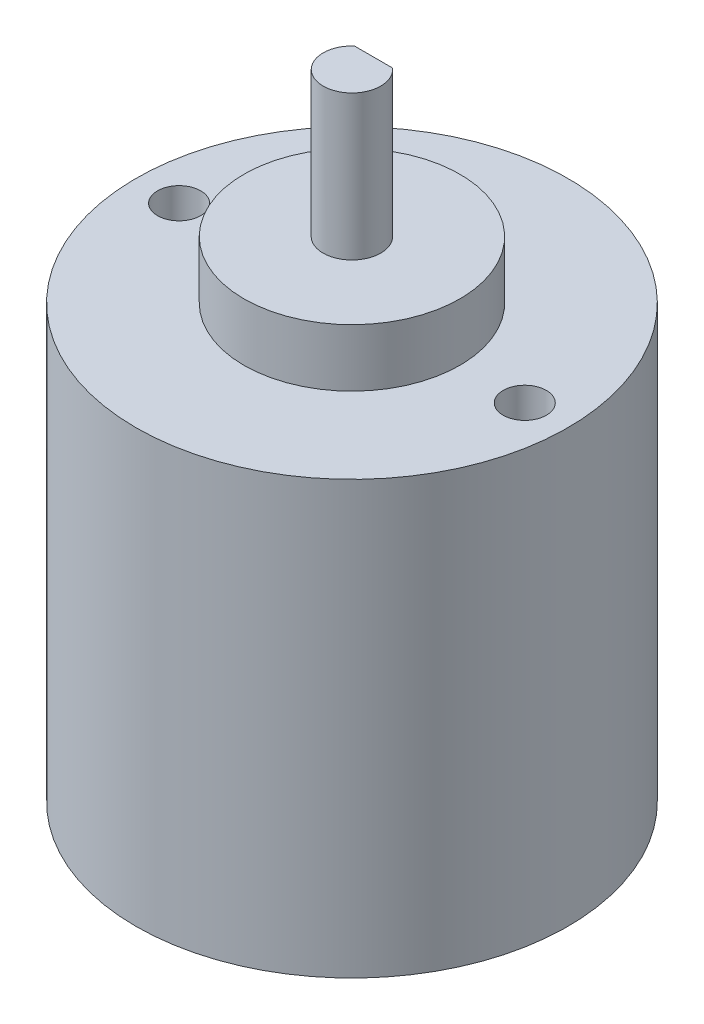
ISO-10303-21;
HEADER;
FILE_DESCRIPTION(('STEP AP214'),'2;1');
FILE_NAME('part.step','',(''),(''),'','','');
FILE_SCHEMA(('AUTOMOTIVE_DESIGN { 1 0 10303 214 1 1 1 1 }'));
ENDSEC;
DATA;
#1=APPLICATION_CONTEXT('core data for automotive mechanical design processes');
#2=APPLICATION_PROTOCOL_DEFINITION('international standard','automotive_design',2000,#1);
#3=PRODUCT_CONTEXT('',#1,'mechanical');
#4=PRODUCT('Part','Part','',(#3));
#5=PRODUCT_RELATED_PRODUCT_CATEGORY('part','',(#4));
#6=PRODUCT_DEFINITION_FORMATION('','',#4);
#7=PRODUCT_DEFINITION_CONTEXT('part definition',#1,'design');
#8=PRODUCT_DEFINITION('design','',#6,#7);
#9=PRODUCT_DEFINITION_SHAPE('','',#8);
#10=(LENGTH_UNIT() NAMED_UNIT(*) SI_UNIT(.MILLI.,.METRE.));
#11=(NAMED_UNIT(*) PLANE_ANGLE_UNIT() SI_UNIT($,.RADIAN.));
#12=(NAMED_UNIT(*) SI_UNIT($,.STERADIAN.) SOLID_ANGLE_UNIT());
#13=UNCERTAINTY_MEASURE_WITH_UNIT(LENGTH_MEASURE(1.E-05),#10,'distance_accuracy_value','');
#14=(GEOMETRIC_REPRESENTATION_CONTEXT(3) GLOBAL_UNCERTAINTY_ASSIGNED_CONTEXT((#13)) GLOBAL_UNIT_ASSIGNED_CONTEXT((#10,
#11,#12)) REPRESENTATION_CONTEXT('',''));
#15=CARTESIAN_POINT('',(0.,0.,0.));
#16=DIRECTION('',(0.,0.,1.));
#17=DIRECTION('',(1.,0.,0.));
#18=AXIS2_PLACEMENT_3D('',#15,#16,#17);
#19=CARTESIAN_POINT('',(0.,30.,0.));
#20=DIRECTION('',(0.,-1.,0.));
#21=DIRECTION('',(0.,0.,-1.));
#22=AXIS2_PLACEMENT_3D('',#19,#20,#21);
#23=CYLINDRICAL_SURFACE('',#22,15.);
#24=CARTESIAN_POINT('',(0.,30.,0.));
#25=DIRECTION('',(0.,1.,0.));
#26=DIRECTION('',(0.,0.,1.));
#27=AXIS2_PLACEMENT_3D('',#24,#25,#26);
#28=CIRCLE('',#27,15.);
#29=CARTESIAN_POINT('',(0.,30.,15.));
#30=VERTEX_POINT('',#29);
#31=EDGE_CURVE('E98',#30,#30,#28,.T.);
#32=ORIENTED_EDGE('',*,*,#31,.F.);
#33=EDGE_LOOP('',(#32));
#34=FACE_BOUND('',#33,.T.);
#35=CARTESIAN_POINT('',(0.,0.,0.));
#36=DIRECTION('',(0.,1.,0.));
#37=DIRECTION('',(0.,0.,1.));
#38=AXIS2_PLACEMENT_3D('',#35,#36,#37);
#39=CIRCLE('',#38,15.);
#40=CARTESIAN_POINT('',(0.,0.,15.));
#41=VERTEX_POINT('',#40);
#42=EDGE_CURVE('E111',#41,#41,#39,.T.);
#43=ORIENTED_EDGE('',*,*,#42,.T.);
#44=EDGE_LOOP('',(#43));
#45=FACE_BOUND('',#44,.T.);
#46=ADVANCED_FACE('F42',(#34,#45),#23,.T.);
#47=CARTESIAN_POINT('',(0.,30.,0.));
#48=DIRECTION('',(0.,1.,0.));
#49=DIRECTION('',(0.,0.,1.));
#50=AXIS2_PLACEMENT_3D('',#47,#48,#49);
#51=PLANE('',#50);
#52=CARTESIAN_POINT('',(0.,30.,0.));
#53=DIRECTION('',(0.,1.,0.));
#54=DIRECTION('',(0.,0.,1.));
#55=AXIS2_PLACEMENT_3D('',#52,#53,#54);
#56=CIRCLE('',#55,7.5);
#57=CARTESIAN_POINT('',(0.,30.,7.5));
#58=VERTEX_POINT('',#57);
#59=EDGE_CURVE('E75',#58,#58,#56,.T.);
#60=ORIENTED_EDGE('',*,*,#59,.F.);
#61=EDGE_LOOP('',(#60));
#62=FACE_BOUND('',#61,.T.);
#63=CARTESIAN_POINT('',(12.005,30.,0.));
#64=DIRECTION('',(0.,1.,0.));
#65=DIRECTION('',(0.,0.,1.));
#66=AXIS2_PLACEMENT_3D('',#63,#64,#65);
#67=CIRCLE('',#66,1.5);
#68=CARTESIAN_POINT('',(12.005,30.,1.5));
#69=VERTEX_POINT('',#68);
#70=EDGE_CURVE('E112',#69,#69,#67,.T.);
#71=ORIENTED_EDGE('',*,*,#70,.F.);
#72=EDGE_LOOP('',(#71));
#73=FACE_BOUND('',#72,.T.);
#74=CARTESIAN_POINT('',(-12.005,30.,0.));
#75=DIRECTION('',(0.,1.,0.));
#76=DIRECTION('',(0.,0.,1.));
#77=AXIS2_PLACEMENT_3D('',#74,#75,#76);
#78=CIRCLE('',#77,1.5);
#79=CARTESIAN_POINT('',(-12.005,30.,1.5));
#80=VERTEX_POINT('',#79);
#81=EDGE_CURVE('E116',#80,#80,#78,.T.);
#82=ORIENTED_EDGE('',*,*,#81,.F.);
#83=EDGE_LOOP('',(#82));
#84=FACE_BOUND('',#83,.T.);
#85=ORIENTED_EDGE('',*,*,#31,.T.);
#86=EDGE_LOOP('',(#85));
#87=FACE_BOUND('',#86,.T.);
#88=ADVANCED_FACE('F133',(#62,#73,#84,#87),#51,.T.);
#89=CARTESIAN_POINT('',(0.,0.,0.));
#90=DIRECTION('',(0.,1.,0.));
#91=DIRECTION('',(0.,0.,1.));
#92=AXIS2_PLACEMENT_3D('',#89,#90,#91);
#93=PLANE('',#92);
#94=CARTESIAN_POINT('',(0.,0.,-8.));
#95=DIRECTION('',(0.,1.,0.));
#96=DIRECTION('',(0.,0.,1.));
#97=AXIS2_PLACEMENT_3D('',#94,#95,#96);
#98=CIRCLE('',#97,5.);
#99=CARTESIAN_POINT('',(0.,0.,-3.));
#100=VERTEX_POINT('',#99);
#101=EDGE_CURVE('E11',#100,#100,#98,.F.);
#102=ORIENTED_EDGE('',*,*,#101,.F.);
#103=EDGE_LOOP('',(#102));
#104=FACE_BOUND('',#103,.T.);
#105=ORIENTED_EDGE('',*,*,#42,.F.);
#106=EDGE_LOOP('',(#105));
#107=FACE_BOUND('',#106,.T.);
#108=ADVANCED_FACE('F130',(#104,#107),#93,.F.);
#109=CARTESIAN_POINT('',(-12.005,26.,0.));
#110=DIRECTION('',(0.,1.,0.));
#111=DIRECTION('',(0.,0.,1.));
#112=AXIS2_PLACEMENT_3D('',#109,#110,#111);
#113=CYLINDRICAL_SURFACE('',#112,1.5);
#114=CARTESIAN_POINT('',(-12.005,26.,0.));
#115=DIRECTION('',(0.,1.,0.));
#116=DIRECTION('',(0.,0.,1.));
#117=AXIS2_PLACEMENT_3D('',#114,#115,#116);
#118=CIRCLE('',#117,1.5);
#119=CARTESIAN_POINT('',(-12.005,26.,1.5));
#120=VERTEX_POINT('',#119);
#121=EDGE_CURVE('E103',#120,#120,#118,.T.);
#122=ORIENTED_EDGE('',*,*,#121,.F.);
#123=EDGE_LOOP('',(#122));
#124=FACE_BOUND('',#123,.T.);
#125=ORIENTED_EDGE('',*,*,#81,.T.);
#126=EDGE_LOOP('',(#125));
#127=FACE_BOUND('',#126,.T.);
#128=ADVANCED_FACE('F132',(#124,#127),#113,.F.);
#129=CARTESIAN_POINT('',(-12.005,26.,0.));
#130=DIRECTION('',(0.,1.,0.));
#131=DIRECTION('',(0.,0.,1.));
#132=AXIS2_PLACEMENT_3D('',#129,#130,#131);
#133=PLANE('',#132);
#134=ORIENTED_EDGE('',*,*,#121,.T.);
#135=EDGE_LOOP('',(#134));
#136=FACE_BOUND('',#135,.T.);
#137=ADVANCED_FACE('F139',(#136),#133,.T.);
#138=CARTESIAN_POINT('',(12.005,26.,0.));
#139=DIRECTION('',(0.,1.,0.));
#140=DIRECTION('',(0.,0.,1.));
#141=AXIS2_PLACEMENT_3D('',#138,#139,#140);
#142=CYLINDRICAL_SURFACE('',#141,1.5);
#143=CARTESIAN_POINT('',(12.005,26.,0.));
#144=DIRECTION('',(0.,1.,0.));
#145=DIRECTION('',(0.,0.,1.));
#146=AXIS2_PLACEMENT_3D('',#143,#144,#145);
#147=CIRCLE('',#146,1.5);
#148=CARTESIAN_POINT('',(12.005,26.,1.5));
#149=VERTEX_POINT('',#148);
#150=EDGE_CURVE('E107',#149,#149,#147,.T.);
#151=ORIENTED_EDGE('',*,*,#150,.F.);
#152=EDGE_LOOP('',(#151));
#153=FACE_BOUND('',#152,.T.);
#154=ORIENTED_EDGE('',*,*,#70,.T.);
#155=EDGE_LOOP('',(#154));
#156=FACE_BOUND('',#155,.T.);
#157=ADVANCED_FACE('F268',(#153,#156),#142,.F.);
#158=CARTESIAN_POINT('',(12.005,26.,0.));
#159=DIRECTION('',(0.,1.,0.));
#160=DIRECTION('',(0.,0.,1.));
#161=AXIS2_PLACEMENT_3D('',#158,#159,#160);
#162=PLANE('',#161);
#163=ORIENTED_EDGE('',*,*,#150,.T.);
#164=EDGE_LOOP('',(#163));
#165=FACE_BOUND('',#164,.T.);
#166=ADVANCED_FACE('F164',(#165),#162,.T.);
#167=CARTESIAN_POINT('',(0.,34.,0.));
#168=DIRECTION('',(0.,-1.,0.));
#169=DIRECTION('',(0.,0.,-1.));
#170=AXIS2_PLACEMENT_3D('',#167,#168,#169);
#171=CYLINDRICAL_SURFACE('',#170,7.5);
#172=CARTESIAN_POINT('',(0.,34.,0.));
#173=DIRECTION('',(0.,1.,0.));
#174=DIRECTION('',(0.,0.,1.));
#175=AXIS2_PLACEMENT_3D('',#172,#173,#174);
#176=CIRCLE('',#175,7.5);
#177=CARTESIAN_POINT('',(0.,34.,7.5));
#178=VERTEX_POINT('',#177);
#179=EDGE_CURVE('E99',#178,#178,#176,.T.);
#180=ORIENTED_EDGE('',*,*,#179,.F.);
#181=EDGE_LOOP('',(#180));
#182=FACE_BOUND('',#181,.T.);
#183=ORIENTED_EDGE('',*,*,#59,.T.);
#184=EDGE_LOOP('',(#183));
#185=FACE_BOUND('',#184,.T.);
#186=ADVANCED_FACE('F169',(#182,#185),#171,.T.);
#187=CARTESIAN_POINT('',(0.,34.,0.));
#188=DIRECTION('',(0.,1.,0.));
#189=DIRECTION('',(0.,0.,1.));
#190=AXIS2_PLACEMENT_3D('',#187,#188,#189);
#191=PLANE('',#190);
#192=CARTESIAN_POINT('',(0.,34.,0.));
#193=DIRECTION('',(0.,1.,0.));
#194=DIRECTION('',(0.,0.,1.));
#195=AXIS2_PLACEMENT_3D('',#192,#193,#194);
#196=CIRCLE('',#195,2.);
#197=CARTESIAN_POINT('',(0.,34.,2.));
#198=VERTEX_POINT('',#197);
#199=EDGE_CURVE('E50',#198,#198,#196,.T.);
#200=ORIENTED_EDGE('',*,*,#199,.F.);
#201=EDGE_LOOP('',(#200));
#202=FACE_BOUND('',#201,.T.);
#203=ORIENTED_EDGE('',*,*,#179,.T.);
#204=EDGE_LOOP('',(#203));
#205=FACE_BOUND('',#204,.T.);
#206=ADVANCED_FACE('F174',(#202,#205),#191,.T.);
#207=CARTESIAN_POINT('',(0.,36.05,0.));
#208=DIRECTION('',(0.,-1.,0.));
#209=DIRECTION('',(0.,0.,-1.));
#210=AXIS2_PLACEMENT_3D('',#207,#208,#209);
#211=CYLINDRICAL_SURFACE('',#210,2.);
#212=CARTESIAN_POINT('',(0.,36.05,0.));
#213=DIRECTION('',(0.,1.,0.));
#214=DIRECTION('',(0.,0.,1.));
#215=AXIS2_PLACEMENT_3D('',#212,#213,#214);
#216=CIRCLE('',#215,2.);
#217=CARTESIAN_POINT('',(1.3228756555323,36.05,-1.5));
#218=VERTEX_POINT('',#217);
#219=CARTESIAN_POINT('',(-1.3228756555323,36.05,-1.5));
#220=VERTEX_POINT('',#219);
#221=EDGE_CURVE('E68',#218,#220,#216,.T.);
#222=ORIENTED_EDGE('',*,*,#221,.F.);
#223=DIRECTION('',(0.,-1.,0.));
#224=VECTOR('',#223,1.);
#225=CARTESIAN_POINT('',(1.3228756555323,44.05,-1.5));
#226=LINE('',#225,#224);
#227=CARTESIAN_POINT('',(1.3228756555323,44.05,-1.5));
#228=VERTEX_POINT('',#227);
#229=EDGE_CURVE('E76',#228,#218,#226,.T.);
#230=ORIENTED_EDGE('',*,*,#229,.F.);
#231=CARTESIAN_POINT('',(0.,44.05,0.));
#232=DIRECTION('',(0.,1.,0.));
#233=DIRECTION('',(0.,0.,1.));
#234=AXIS2_PLACEMENT_3D('',#231,#232,#233);
#235=CIRCLE('',#234,2.);
#236=CARTESIAN_POINT('',(-1.3228756555323,44.05,-1.5));
#237=VERTEX_POINT('',#236);
#238=EDGE_CURVE('E83',#237,#228,#235,.T.);
#239=ORIENTED_EDGE('',*,*,#238,.F.);
#240=DIRECTION('',(0.,-1.,0.));
#241=VECTOR('',#240,1.);
#242=CARTESIAN_POINT('',(-1.3228756555323,44.05,-1.5));
#243=LINE('',#242,#241);
#244=EDGE_CURVE('E80',#237,#220,#243,.T.);
#245=ORIENTED_EDGE('',*,*,#244,.T.);
#246=EDGE_LOOP('',(#222,#230,#239,#245));
#247=FACE_BOUND('',#246,.T.);
#248=ORIENTED_EDGE('',*,*,#199,.T.);
#249=EDGE_LOOP('',(#248));
#250=FACE_BOUND('',#249,.T.);
#251=ADVANCED_FACE('F86',(#247,#250),#211,.T.);
#252=CARTESIAN_POINT('',(0.,36.05,0.));
#253=DIRECTION('',(0.,1.,0.));
#254=DIRECTION('',(0.,0.,1.));
#255=AXIS2_PLACEMENT_3D('',#252,#253,#254);
#256=PLANE('',#255);
#257=DIRECTION('',(-1.,0.,0.));
#258=VECTOR('',#257,1.);
#259=CARTESIAN_POINT('',(-1.3228756555323,36.05,-1.5));
#260=LINE('',#259,#258);
#261=EDGE_CURVE('E56',#218,#220,#260,.T.);
#262=ORIENTED_EDGE('',*,*,#261,.F.);
#263=ORIENTED_EDGE('',*,*,#221,.T.);
#264=EDGE_LOOP('',(#262,#263));
#265=FACE_BOUND('',#264,.T.);
#266=ADVANCED_FACE('F69',(#265),#256,.T.);
#267=CARTESIAN_POINT('',(-1.3228756555323,44.05,-1.5));
#268=DIRECTION('',(0.,0.,1.));
#269=DIRECTION('',(1.,0.,0.));
#270=AXIS2_PLACEMENT_3D('',#267,#268,#269);
#271=PLANE('',#270);
#272=ORIENTED_EDGE('',*,*,#261,.T.);
#273=ORIENTED_EDGE('',*,*,#244,.F.);
#274=DIRECTION('',(-1.,0.,0.));
#275=VECTOR('',#274,1.);
#276=CARTESIAN_POINT('',(-1.3228756555323,44.05,-1.5));
#277=LINE('',#276,#275);
#278=EDGE_CURVE('E64',#228,#237,#277,.T.);
#279=ORIENTED_EDGE('',*,*,#278,.F.);
#280=ORIENTED_EDGE('',*,*,#229,.T.);
#281=EDGE_LOOP('',(#272,#273,#279,#280));
#282=FACE_BOUND('',#281,.T.);
#283=ADVANCED_FACE('F79',(#282),#271,.F.);
#284=CARTESIAN_POINT('',(0.,44.05,0.));
#285=DIRECTION('',(0.,1.,0.));
#286=DIRECTION('',(0.,0.,1.));
#287=AXIS2_PLACEMENT_3D('',#284,#285,#286);
#288=PLANE('',#287);
#289=ORIENTED_EDGE('',*,*,#238,.T.);
#290=ORIENTED_EDGE('',*,*,#278,.T.);
#291=EDGE_LOOP('',(#289,#290));
#292=FACE_BOUND('',#291,.T.);
#293=ADVANCED_FACE('F213',(#292),#288,.T.);
#294=CARTESIAN_POINT('',(0.,-2.5,-8.));
#295=DIRECTION('',(0.,1.,0.));
#296=DIRECTION('',(0.,0.,1.));
#297=AXIS2_PLACEMENT_3D('',#294,#295,#296);
#298=CYLINDRICAL_SURFACE('',#297,5.);
#299=CARTESIAN_POINT('',(0.,-2.5,-8.));
#300=DIRECTION('',(0.,-1.,0.));
#301=DIRECTION('',(0.,0.,-1.));
#302=AXIS2_PLACEMENT_3D('',#299,#300,#301);
#303=CIRCLE('',#302,5.);
#304=CARTESIAN_POINT('',(0.,-2.5,-13.));
#305=VERTEX_POINT('',#304);
#306=EDGE_CURVE('E84',#305,#305,#303,.T.);
#307=ORIENTED_EDGE('',*,*,#306,.F.);
#308=EDGE_LOOP('',(#307));
#309=FACE_BOUND('',#308,.T.);
#310=ORIENTED_EDGE('',*,*,#101,.T.);
#311=EDGE_LOOP('',(#310));
#312=FACE_BOUND('',#311,.T.);
#313=ADVANCED_FACE('F222',(#309,#312),#298,.T.);
#314=CARTESIAN_POINT('',(0.,-2.5,-8.));
#315=DIRECTION('',(0.,-1.,0.));
#316=DIRECTION('',(0.,0.,-1.));
#317=AXIS2_PLACEMENT_3D('',#314,#315,#316);
#318=PLANE('',#317);
#319=ORIENTED_EDGE('',*,*,#306,.T.);
#320=EDGE_LOOP('',(#319));
#321=FACE_BOUND('',#320,.T.);
#322=ADVANCED_FACE('F238',(#321),#318,.T.);
#323=CLOSED_SHELL('',(#46,#88,#108,#128,#137,#157,#166,#186,#206,#251,#266,#283,#293,#313,#322));
#324=MANIFOLD_SOLID_BREP('B2',#323);
#325=ADVANCED_BREP_SHAPE_REPRESENTATION('',(#18,#324),#14);
#326=SHAPE_DEFINITION_REPRESENTATION(#9,#325);
ENDSEC;
END-ISO-10303-21;
